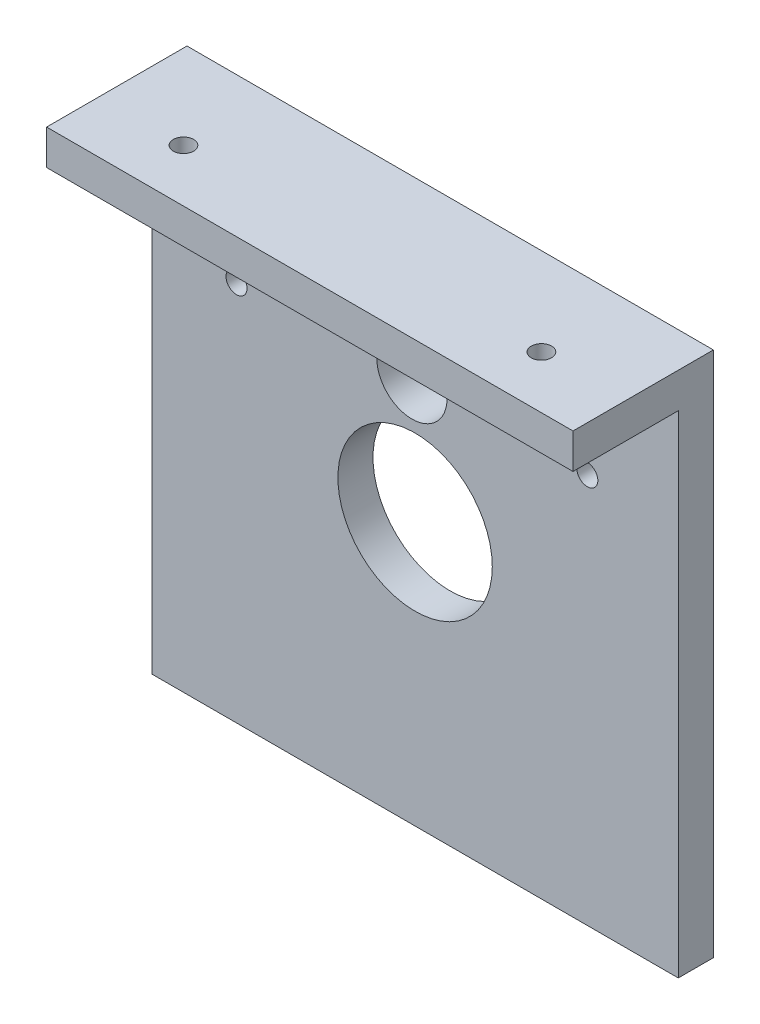
ISO-10303-21;
HEADER;
FILE_DESCRIPTION(('STEP AP214'),'2;1');
FILE_NAME('part.step','',(''),(''),'','','');
FILE_SCHEMA(('AUTOMOTIVE_DESIGN { 1 0 10303 214 1 1 1 1 }'));
ENDSEC;
DATA;
#1=APPLICATION_CONTEXT('core data for automotive mechanical design processes');
#2=APPLICATION_PROTOCOL_DEFINITION('international standard','automotive_design',2000,#1);
#3=PRODUCT_CONTEXT('',#1,'mechanical');
#4=PRODUCT('Part','Part','',(#3));
#5=PRODUCT_RELATED_PRODUCT_CATEGORY('part','',(#4));
#6=PRODUCT_DEFINITION_FORMATION('','',#4);
#7=PRODUCT_DEFINITION_CONTEXT('part definition',#1,'design');
#8=PRODUCT_DEFINITION('design','',#6,#7);
#9=PRODUCT_DEFINITION_SHAPE('','',#8);
#10=(LENGTH_UNIT() NAMED_UNIT(*) SI_UNIT(.MILLI.,.METRE.));
#11=(NAMED_UNIT(*) PLANE_ANGLE_UNIT() SI_UNIT($,.RADIAN.));
#12=(NAMED_UNIT(*) SI_UNIT($,.STERADIAN.) SOLID_ANGLE_UNIT());
#13=UNCERTAINTY_MEASURE_WITH_UNIT(LENGTH_MEASURE(1.E-05),#10,'distance_accuracy_value','');
#14=(GEOMETRIC_REPRESENTATION_CONTEXT(3) GLOBAL_UNCERTAINTY_ASSIGNED_CONTEXT((#13)) GLOBAL_UNIT_ASSIGNED_CONTEXT((#10,
#11,#12)) REPRESENTATION_CONTEXT('',''));
#15=CARTESIAN_POINT('',(0.,0.,0.));
#16=DIRECTION('',(0.,0.,1.));
#17=DIRECTION('',(1.,0.,0.));
#18=AXIS2_PLACEMENT_3D('',#15,#16,#17);
#19=CARTESIAN_POINT('',(0.,0.,5.));
#20=DIRECTION('',(0.,0.,1.));
#21=DIRECTION('',(1.,0.,0.));
#22=AXIS2_PLACEMENT_3D('',#19,#20,#21);
#23=PLANE('',#22);
#24=DIRECTION('',(1.,0.,0.));
#25=VECTOR('',#24,1.);
#26=CARTESIAN_POINT('',(-35.6377340404594,40.0070496723968,5.));
#27=LINE('',#26,#25);
#28=CARTESIAN_POINT('',(-35.6377340404594,40.0070496723968,5.));
#29=VERTEX_POINT('',#28);
#30=CARTESIAN_POINT('',(39.3622659595406,40.0070496723968,5.));
#31=VERTEX_POINT('',#30);
#32=EDGE_CURVE('E50',#29,#31,#27,.T.);
#33=ORIENTED_EDGE('',*,*,#32,.F.);
#34=DIRECTION('',(0.,-1.,0.));
#35=VECTOR('',#34,1.);
#36=CARTESIAN_POINT('',(-35.6377340404594,45.0070496723968,5.));
#37=LINE('',#36,#35);
#38=CARTESIAN_POINT('',(-35.6377340404594,-29.9929503276032,5.));
#39=VERTEX_POINT('',#38);
#40=EDGE_CURVE('E87',#29,#39,#37,.T.);
#41=ORIENTED_EDGE('',*,*,#40,.T.);
#42=DIRECTION('',(1.,0.,0.));
#43=VECTOR('',#42,1.);
#44=CARTESIAN_POINT('',(-35.6377340404594,-29.9929503276032,5.));
#45=LINE('',#44,#43);
#46=CARTESIAN_POINT('',(39.3622659595406,-29.9929503276032,5.));
#47=VERTEX_POINT('',#46);
#48=EDGE_CURVE('E56',#39,#47,#45,.T.);
#49=ORIENTED_EDGE('',*,*,#48,.T.);
#50=DIRECTION('',(0.,1.,0.));
#51=VECTOR('',#50,1.);
#52=CARTESIAN_POINT('',(39.3622659595406,45.0070496723968,5.));
#53=LINE('',#52,#51);
#54=EDGE_CURVE('E98',#47,#31,#53,.T.);
#55=ORIENTED_EDGE('',*,*,#54,.T.);
#56=EDGE_LOOP('',(#33,#41,#49,#55));
#57=FACE_BOUND('',#56,.T.);
#58=CARTESIAN_POINT('',(-23.5824724793545,24.353867941026,5.));
#59=DIRECTION('',(0.,0.,1.));
#60=DIRECTION('',(1.,0.,0.));
#61=AXIS2_PLACEMENT_3D('',#58,#59,#60);
#62=CIRCLE('',#61,1.5);
#63=CARTESIAN_POINT('',(-22.0824724793545,24.353867941026,5.));
#64=VERTEX_POINT('',#63);
#65=EDGE_CURVE('E157',#64,#64,#62,.T.);
#66=ORIENTED_EDGE('',*,*,#65,.F.);
#67=EDGE_LOOP('',(#66));
#68=FACE_BOUND('',#67,.T.);
#69=CARTESIAN_POINT('',(1.86226595954061,7.50704967239682,5.));
#70=DIRECTION('',(0.,0.,1.));
#71=DIRECTION('',(1.,0.,0.));
#72=AXIS2_PLACEMENT_3D('',#69,#70,#71);
#73=CIRCLE('',#72,11.);
#74=CARTESIAN_POINT('',(12.8622659595406,7.50704967239682,5.));
#75=VERTEX_POINT('',#74);
#76=EDGE_CURVE('E103',#75,#75,#73,.T.);
#77=ORIENTED_EDGE('',*,*,#76,.F.);
#78=EDGE_LOOP('',(#77));
#79=FACE_BOUND('',#78,.T.);
#80=CARTESIAN_POINT('',(1.40914579375659,25.0011824635746,5.));
#81=DIRECTION('',(0.,0.,1.));
#82=DIRECTION('',(1.,0.,0.));
#83=AXIS2_PLACEMENT_3D('',#80,#81,#82);
#84=CIRCLE('',#83,5.00000000000007);
#85=CARTESIAN_POINT('',(6.40914579375666,25.0011824635746,5.));
#86=VERTEX_POINT('',#85);
#87=EDGE_CURVE('E163',#86,#86,#84,.T.);
#88=ORIENTED_EDGE('',*,*,#87,.F.);
#89=EDGE_LOOP('',(#88));
#90=FACE_BOUND('',#89,.T.);
#91=CARTESIAN_POINT('',(26.4007640668676,25.648496986123,5.));
#92=DIRECTION('',(0.,0.,1.));
#93=DIRECTION('',(1.,0.,0.));
#94=AXIS2_PLACEMENT_3D('',#91,#92,#93);
#95=CIRCLE('',#94,1.5);
#96=CARTESIAN_POINT('',(27.9007640668676,25.648496986123,5.));
#97=VERTEX_POINT('',#96);
#98=EDGE_CURVE('E151',#97,#97,#95,.T.);
#99=ORIENTED_EDGE('',*,*,#98,.F.);
#100=EDGE_LOOP('',(#99));
#101=FACE_BOUND('',#100,.T.);
#102=ADVANCED_FACE('F33',(#57,#68,#79,#90,#101),#23,.T.);
#103=CARTESIAN_POINT('',(0.,0.,0.));
#104=DIRECTION('',(0.,0.,1.));
#105=DIRECTION('',(1.,0.,0.));
#106=AXIS2_PLACEMENT_3D('',#103,#104,#105);
#107=PLANE('',#106);
#108=CARTESIAN_POINT('',(-23.5824724793545,24.353867941026,0.));
#109=DIRECTION('',(0.,0.,1.));
#110=DIRECTION('',(1.,0.,0.));
#111=AXIS2_PLACEMENT_3D('',#108,#109,#110);
#112=CIRCLE('',#111,1.5);
#113=CARTESIAN_POINT('',(-22.0824724793545,24.353867941026,0.));
#114=VERTEX_POINT('',#113);
#115=EDGE_CURVE('E154',#114,#114,#112,.T.);
#116=ORIENTED_EDGE('',*,*,#115,.T.);
#117=EDGE_LOOP('',(#116));
#118=FACE_BOUND('',#117,.T.);
#119=CARTESIAN_POINT('',(1.86226595954061,7.50704967239682,0.));
#120=DIRECTION('',(0.,0.,1.));
#121=DIRECTION('',(1.,0.,0.));
#122=AXIS2_PLACEMENT_3D('',#119,#120,#121);
#123=CIRCLE('',#122,11.);
#124=CARTESIAN_POINT('',(12.8622659595406,7.50704967239682,0.));
#125=VERTEX_POINT('',#124);
#126=EDGE_CURVE('E107',#125,#125,#123,.T.);
#127=ORIENTED_EDGE('',*,*,#126,.T.);
#128=EDGE_LOOP('',(#127));
#129=FACE_BOUND('',#128,.T.);
#130=DIRECTION('',(0.,-1.,0.));
#131=VECTOR('',#130,1.);
#132=CARTESIAN_POINT('',(-35.6377340404594,45.0070496723968,0.));
#133=LINE('',#132,#131);
#134=CARTESIAN_POINT('',(-35.6377340404594,45.0070496723968,0.));
#135=VERTEX_POINT('',#134);
#136=CARTESIAN_POINT('',(-35.6377340404594,-29.9929503276032,0.));
#137=VERTEX_POINT('',#136);
#138=EDGE_CURVE('E94',#135,#137,#133,.T.);
#139=ORIENTED_EDGE('',*,*,#138,.F.);
#140=DIRECTION('',(-1.,0.,0.));
#141=VECTOR('',#140,1.);
#142=CARTESIAN_POINT('',(-35.6377340404594,45.0070496723968,0.));
#143=LINE('',#142,#141);
#144=CARTESIAN_POINT('',(39.3622659595406,45.0070496723968,0.));
#145=VERTEX_POINT('',#144);
#146=EDGE_CURVE('E76',#145,#135,#143,.T.);
#147=ORIENTED_EDGE('',*,*,#146,.F.);
#148=DIRECTION('',(0.,1.,0.));
#149=VECTOR('',#148,1.);
#150=CARTESIAN_POINT('',(39.3622659595406,45.0070496723968,0.));
#151=LINE('',#150,#149);
#152=CARTESIAN_POINT('',(39.3622659595406,-29.9929503276032,0.));
#153=VERTEX_POINT('',#152);
#154=EDGE_CURVE('E88',#153,#145,#151,.T.);
#155=ORIENTED_EDGE('',*,*,#154,.F.);
#156=DIRECTION('',(1.,0.,0.));
#157=VECTOR('',#156,1.);
#158=CARTESIAN_POINT('',(-35.6377340404594,-29.9929503276032,0.));
#159=LINE('',#158,#157);
#160=EDGE_CURVE('E102',#137,#153,#159,.T.);
#161=ORIENTED_EDGE('',*,*,#160,.F.);
#162=EDGE_LOOP('',(#139,#147,#155,#161));
#163=FACE_BOUND('',#162,.T.);
#164=CARTESIAN_POINT('',(1.40914579375659,25.0011824635746,0.));
#165=DIRECTION('',(0.,0.,1.));
#166=DIRECTION('',(1.,0.,0.));
#167=AXIS2_PLACEMENT_3D('',#164,#165,#166);
#168=CIRCLE('',#167,5.00000000000007);
#169=CARTESIAN_POINT('',(6.40914579375666,25.0011824635746,0.));
#170=VERTEX_POINT('',#169);
#171=EDGE_CURVE('E160',#170,#170,#168,.T.);
#172=ORIENTED_EDGE('',*,*,#171,.T.);
#173=EDGE_LOOP('',(#172));
#174=FACE_BOUND('',#173,.T.);
#175=CARTESIAN_POINT('',(26.4007640668676,25.648496986123,0.));
#176=DIRECTION('',(0.,0.,1.));
#177=DIRECTION('',(1.,0.,0.));
#178=AXIS2_PLACEMENT_3D('',#175,#176,#177);
#179=CIRCLE('',#178,1.5);
#180=CARTESIAN_POINT('',(27.9007640668676,25.648496986123,0.));
#181=VERTEX_POINT('',#180);
#182=EDGE_CURVE('E143',#181,#181,#179,.T.);
#183=ORIENTED_EDGE('',*,*,#182,.T.);
#184=EDGE_LOOP('',(#183));
#185=FACE_BOUND('',#184,.T.);
#186=ADVANCED_FACE('F100',(#118,#129,#163,#174,#185),#107,.F.);
#187=CARTESIAN_POINT('',(-35.6377340404594,45.0070496723968,5.));
#188=DIRECTION('',(1.,0.,0.));
#189=DIRECTION('',(0.,0.,-1.));
#190=AXIS2_PLACEMENT_3D('',#187,#188,#189);
#191=PLANE('',#190);
#192=ORIENTED_EDGE('',*,*,#138,.T.);
#193=DIRECTION('',(0.,0.,-1.));
#194=VECTOR('',#193,1.);
#195=CARTESIAN_POINT('',(-35.6377340404594,-29.9929503276032,5.));
#196=LINE('',#195,#194);
#197=EDGE_CURVE('E11',#39,#137,#196,.T.);
#198=ORIENTED_EDGE('',*,*,#197,.F.);
#199=ORIENTED_EDGE('',*,*,#40,.F.);
#200=DIRECTION('',(0.,0.,-1.));
#201=VECTOR('',#200,1.);
#202=CARTESIAN_POINT('',(-35.6377340404594,40.0070496723968,20.));
#203=LINE('',#202,#201);
#204=CARTESIAN_POINT('',(-35.6377340404594,40.0070496723968,20.));
#205=VERTEX_POINT('',#204);
#206=EDGE_CURVE('E136',#205,#29,#203,.T.);
#207=ORIENTED_EDGE('',*,*,#206,.F.);
#208=DIRECTION('',(0.,-1.,0.));
#209=VECTOR('',#208,1.);
#210=CARTESIAN_POINT('',(-35.6377340404594,45.0070496723968,20.));
#211=LINE('',#210,#209);
#212=CARTESIAN_POINT('',(-35.6377340404594,45.0070496723968,20.));
#213=VERTEX_POINT('',#212);
#214=EDGE_CURVE('E97',#213,#205,#211,.T.);
#215=ORIENTED_EDGE('',*,*,#214,.F.);
#216=DIRECTION('',(0.,0.,-1.));
#217=VECTOR('',#216,1.);
#218=CARTESIAN_POINT('',(-35.6377340404594,45.0070496723968,5.));
#219=LINE('',#218,#217);
#220=EDGE_CURVE('E80',#213,#135,#219,.T.);
#221=ORIENTED_EDGE('',*,*,#220,.T.);
#222=EDGE_LOOP('',(#192,#198,#199,#207,#215,#221));
#223=FACE_BOUND('',#222,.T.);
#224=ADVANCED_FACE('F35',(#223),#191,.F.);
#225=CARTESIAN_POINT('',(-35.6377340404594,-29.9929503276032,5.));
#226=DIRECTION('',(0.,1.,0.));
#227=DIRECTION('',(0.,0.,1.));
#228=AXIS2_PLACEMENT_3D('',#225,#226,#227);
#229=PLANE('',#228);
#230=ORIENTED_EDGE('',*,*,#160,.T.);
#231=DIRECTION('',(0.,0.,-1.));
#232=VECTOR('',#231,1.);
#233=CARTESIAN_POINT('',(39.3622659595406,-29.9929503276032,5.));
#234=LINE('',#233,#232);
#235=EDGE_CURVE('E42',#47,#153,#234,.T.);
#236=ORIENTED_EDGE('',*,*,#235,.F.);
#237=ORIENTED_EDGE('',*,*,#48,.F.);
#238=ORIENTED_EDGE('',*,*,#197,.T.);
#239=EDGE_LOOP('',(#230,#236,#237,#238));
#240=FACE_BOUND('',#239,.T.);
#241=ADVANCED_FACE('F197',(#240),#229,.F.);
#242=CARTESIAN_POINT('',(39.3622659595406,45.0070496723968,5.));
#243=DIRECTION('',(-1.,0.,0.));
#244=DIRECTION('',(0.,-1.,0.));
#245=AXIS2_PLACEMENT_3D('',#242,#243,#244);
#246=PLANE('',#245);
#247=ORIENTED_EDGE('',*,*,#154,.T.);
#248=DIRECTION('',(0.,0.,-1.));
#249=VECTOR('',#248,1.);
#250=CARTESIAN_POINT('',(39.3622659595406,45.0070496723968,5.));
#251=LINE('',#250,#249);
#252=CARTESIAN_POINT('',(39.3622659595406,45.0070496723968,20.));
#253=VERTEX_POINT('',#252);
#254=EDGE_CURVE('E83',#253,#145,#251,.T.);
#255=ORIENTED_EDGE('',*,*,#254,.F.);
#256=DIRECTION('',(0.,1.,0.));
#257=VECTOR('',#256,1.);
#258=CARTESIAN_POINT('',(39.3622659595406,45.0070496723968,20.));
#259=LINE('',#258,#257);
#260=CARTESIAN_POINT('',(39.3622659595406,40.0070496723968,20.));
#261=VERTEX_POINT('',#260);
#262=EDGE_CURVE('E140',#261,#253,#259,.T.);
#263=ORIENTED_EDGE('',*,*,#262,.F.);
#264=DIRECTION('',(0.,0.,-1.));
#265=VECTOR('',#264,1.);
#266=CARTESIAN_POINT('',(39.3622659595406,40.0070496723968,20.));
#267=LINE('',#266,#265);
#268=EDGE_CURVE('E134',#261,#31,#267,.T.);
#269=ORIENTED_EDGE('',*,*,#268,.T.);
#270=ORIENTED_EDGE('',*,*,#54,.F.);
#271=ORIENTED_EDGE('',*,*,#235,.T.);
#272=EDGE_LOOP('',(#247,#255,#263,#269,#270,#271));
#273=FACE_BOUND('',#272,.T.);
#274=ADVANCED_FACE('F138',(#273),#246,.F.);
#275=CARTESIAN_POINT('',(-35.6377340404594,45.0070496723968,5.));
#276=DIRECTION('',(0.,-1.,0.));
#277=DIRECTION('',(1.,0.,0.));
#278=AXIS2_PLACEMENT_3D('',#275,#276,#277);
#279=PLANE('',#278);
#280=CARTESIAN_POINT('',(27.3622659595406,45.0070496723968,12.5));
#281=DIRECTION('',(0.,-1.,0.));
#282=DIRECTION('',(0.,0.,-1.));
#283=AXIS2_PLACEMENT_3D('',#280,#281,#282);
#284=CIRCLE('',#283,1.44999999999999);
#285=CARTESIAN_POINT('',(27.3622659595406,45.0070496723968,11.05));
#286=VERTEX_POINT('',#285);
#287=EDGE_CURVE('E220',#286,#286,#284,.T.);
#288=ORIENTED_EDGE('',*,*,#287,.T.);
#289=EDGE_LOOP('',(#288));
#290=FACE_BOUND('',#289,.T.);
#291=CARTESIAN_POINT('',(-23.6377340404594,45.0070496723968,12.5));
#292=DIRECTION('',(0.,-1.,0.));
#293=DIRECTION('',(0.,0.,-1.));
#294=AXIS2_PLACEMENT_3D('',#291,#292,#293);
#295=CIRCLE('',#294,1.44999999999999);
#296=CARTESIAN_POINT('',(-23.6377340404594,45.0070496723968,11.05));
#297=VERTEX_POINT('',#296);
#298=EDGE_CURVE('E137',#297,#297,#295,.T.);
#299=ORIENTED_EDGE('',*,*,#298,.T.);
#300=EDGE_LOOP('',(#299));
#301=FACE_BOUND('',#300,.T.);
#302=ORIENTED_EDGE('',*,*,#146,.T.);
#303=ORIENTED_EDGE('',*,*,#220,.F.);
#304=DIRECTION('',(-1.,0.,0.));
#305=VECTOR('',#304,1.);
#306=CARTESIAN_POINT('',(-35.6377340404594,45.0070496723968,20.));
#307=LINE('',#306,#305);
#308=EDGE_CURVE('E141',#253,#213,#307,.T.);
#309=ORIENTED_EDGE('',*,*,#308,.F.);
#310=ORIENTED_EDGE('',*,*,#254,.T.);
#311=EDGE_LOOP('',(#302,#303,#309,#310));
#312=FACE_BOUND('',#311,.T.);
#313=ADVANCED_FACE('F78',(#290,#301,#312),#279,.F.);
#314=CARTESIAN_POINT('',(1.86226595954061,7.50704967239682,5.));
#315=DIRECTION('',(0.,0.,-1.));
#316=DIRECTION('',(-1.,0.,0.));
#317=AXIS2_PLACEMENT_3D('',#314,#315,#316);
#318=CYLINDRICAL_SURFACE('',#317,11.);
#319=ORIENTED_EDGE('',*,*,#76,.T.);
#320=EDGE_LOOP('',(#319));
#321=FACE_BOUND('',#320,.T.);
#322=ORIENTED_EDGE('',*,*,#126,.F.);
#323=EDGE_LOOP('',(#322));
#324=FACE_BOUND('',#323,.T.);
#325=ADVANCED_FACE('F173',(#321,#324),#318,.F.);
#326=CARTESIAN_POINT('',(1.40914579375659,25.0011824635746,5.));
#327=DIRECTION('',(0.,0.,-1.));
#328=DIRECTION('',(-1.,0.,0.));
#329=AXIS2_PLACEMENT_3D('',#326,#327,#328);
#330=CYLINDRICAL_SURFACE('',#329,5.00000000000007);
#331=ORIENTED_EDGE('',*,*,#87,.T.);
#332=EDGE_LOOP('',(#331));
#333=FACE_BOUND('',#332,.T.);
#334=ORIENTED_EDGE('',*,*,#171,.F.);
#335=EDGE_LOOP('',(#334));
#336=FACE_BOUND('',#335,.T.);
#337=ADVANCED_FACE('F170',(#333,#336),#330,.F.);
#338=CARTESIAN_POINT('',(-23.5824724793545,24.353867941026,5.));
#339=DIRECTION('',(0.,0.,-1.));
#340=DIRECTION('',(-1.,0.,0.));
#341=AXIS2_PLACEMENT_3D('',#338,#339,#340);
#342=CYLINDRICAL_SURFACE('',#341,1.5);
#343=ORIENTED_EDGE('',*,*,#65,.T.);
#344=EDGE_LOOP('',(#343));
#345=FACE_BOUND('',#344,.T.);
#346=ORIENTED_EDGE('',*,*,#115,.F.);
#347=EDGE_LOOP('',(#346));
#348=FACE_BOUND('',#347,.T.);
#349=ADVANCED_FACE('F172',(#345,#348),#342,.F.);
#350=CARTESIAN_POINT('',(26.4007640668676,25.648496986123,5.));
#351=DIRECTION('',(0.,0.,-1.));
#352=DIRECTION('',(-1.,0.,0.));
#353=AXIS2_PLACEMENT_3D('',#350,#351,#352);
#354=CYLINDRICAL_SURFACE('',#353,1.5);
#355=ORIENTED_EDGE('',*,*,#98,.T.);
#356=EDGE_LOOP('',(#355));
#357=FACE_BOUND('',#356,.T.);
#358=ORIENTED_EDGE('',*,*,#182,.F.);
#359=EDGE_LOOP('',(#358));
#360=FACE_BOUND('',#359,.T.);
#361=ADVANCED_FACE('F180',(#357,#360),#354,.F.);
#362=CARTESIAN_POINT('',(-35.6377340404594,40.0070496723968,20.));
#363=DIRECTION('',(0.,1.,0.));
#364=DIRECTION('',(0.,0.,1.));
#365=AXIS2_PLACEMENT_3D('',#362,#363,#364);
#366=PLANE('',#365);
#367=CARTESIAN_POINT('',(27.3622659595406,40.0070496723968,12.5));
#368=DIRECTION('',(0.,-1.,0.));
#369=DIRECTION('',(0.,0.,-1.));
#370=AXIS2_PLACEMENT_3D('',#367,#368,#369);
#371=CIRCLE('',#370,2.75);
#372=CARTESIAN_POINT('',(27.3622659595406,40.0070496723968,9.75));
#373=VERTEX_POINT('',#372);
#374=EDGE_CURVE('E226',#373,#373,#371,.T.);
#375=ORIENTED_EDGE('',*,*,#374,.F.);
#376=EDGE_LOOP('',(#375));
#377=FACE_BOUND('',#376,.T.);
#378=CARTESIAN_POINT('',(-23.6377340404594,40.0070496723968,12.5));
#379=DIRECTION('',(0.,-1.,0.));
#380=DIRECTION('',(0.,0.,-1.));
#381=AXIS2_PLACEMENT_3D('',#378,#379,#380);
#382=CIRCLE('',#381,2.75);
#383=CARTESIAN_POINT('',(-23.6377340404594,40.0070496723968,9.75));
#384=VERTEX_POINT('',#383);
#385=EDGE_CURVE('E217',#384,#384,#382,.T.);
#386=ORIENTED_EDGE('',*,*,#385,.F.);
#387=EDGE_LOOP('',(#386));
#388=FACE_BOUND('',#387,.T.);
#389=ORIENTED_EDGE('',*,*,#32,.T.);
#390=ORIENTED_EDGE('',*,*,#268,.F.);
#391=DIRECTION('',(1.,0.,0.));
#392=VECTOR('',#391,1.);
#393=CARTESIAN_POINT('',(-35.6377340404594,40.0070496723968,20.));
#394=LINE('',#393,#392);
#395=EDGE_CURVE('E208',#205,#261,#394,.T.);
#396=ORIENTED_EDGE('',*,*,#395,.F.);
#397=ORIENTED_EDGE('',*,*,#206,.T.);
#398=EDGE_LOOP('',(#389,#390,#396,#397));
#399=FACE_BOUND('',#398,.T.);
#400=ADVANCED_FACE('F131',(#377,#388,#399),#366,.F.);
#401=CARTESIAN_POINT('',(0.,0.,20.));
#402=DIRECTION('',(0.,0.,1.));
#403=DIRECTION('',(1.,0.,0.));
#404=AXIS2_PLACEMENT_3D('',#401,#402,#403);
#405=PLANE('',#404);
#406=ORIENTED_EDGE('',*,*,#214,.T.);
#407=ORIENTED_EDGE('',*,*,#395,.T.);
#408=ORIENTED_EDGE('',*,*,#262,.T.);
#409=ORIENTED_EDGE('',*,*,#308,.T.);
#410=EDGE_LOOP('',(#406,#407,#408,#409));
#411=FACE_BOUND('',#410,.T.);
#412=ADVANCED_FACE('F207',(#411),#405,.T.);
#413=CARTESIAN_POINT('',(-23.6377340404594,40.0070496723968,12.5));
#414=DIRECTION('',(0.,-1.,0.));
#415=DIRECTION('',(0.,0.,-1.));
#416=AXIS2_PLACEMENT_3D('',#413,#414,#415);
#417=CYLINDRICAL_SURFACE('',#416,1.44999999999999);
#418=ORIENTED_EDGE('',*,*,#298,.F.);
#419=EDGE_LOOP('',(#418));
#420=FACE_BOUND('',#419,.T.);
#421=CARTESIAN_POINT('',(-23.6377340404594,41.3070496723968,12.5));
#422=DIRECTION('',(0.,-1.,0.));
#423=DIRECTION('',(0.,0.,-1.));
#424=AXIS2_PLACEMENT_3D('',#421,#422,#423);
#425=CIRCLE('',#424,1.44999999999999);
#426=CARTESIAN_POINT('',(-23.6377340404594,41.3070496723968,11.05));
#427=VERTEX_POINT('',#426);
#428=EDGE_CURVE('E214',#427,#427,#425,.T.);
#429=ORIENTED_EDGE('',*,*,#428,.T.);
#430=EDGE_LOOP('',(#429));
#431=FACE_BOUND('',#430,.T.);
#432=ADVANCED_FACE('F240',(#420,#431),#417,.F.);
#433=CARTESIAN_POINT('',(-23.6377340404594,40.0070496723968,12.5));
#434=DIRECTION('',(0.,-1.,0.));
#435=DIRECTION('',(0.,0.,-1.));
#436=AXIS2_PLACEMENT_3D('',#433,#434,#435);
#437=CONICAL_SURFACE('',#436,2.75,0.785398163397448);
#438=ORIENTED_EDGE('',*,*,#428,.F.);
#439=EDGE_LOOP('',(#438));
#440=FACE_BOUND('',#439,.T.);
#441=ORIENTED_EDGE('',*,*,#385,.T.);
#442=EDGE_LOOP('',(#441));
#443=FACE_BOUND('',#442,.T.);
#444=ADVANCED_FACE('F237',(#440,#443),#437,.F.);
#445=CARTESIAN_POINT('',(27.3622659595406,40.0070496723968,12.5));
#446=DIRECTION('',(0.,-1.,0.));
#447=DIRECTION('',(0.,0.,-1.));
#448=AXIS2_PLACEMENT_3D('',#445,#446,#447);
#449=CYLINDRICAL_SURFACE('',#448,1.44999999999999);
#450=ORIENTED_EDGE('',*,*,#287,.F.);
#451=EDGE_LOOP('',(#450));
#452=FACE_BOUND('',#451,.T.);
#453=CARTESIAN_POINT('',(27.3622659595406,41.3070496723968,12.5));
#454=DIRECTION('',(0.,-1.,0.));
#455=DIRECTION('',(0.,0.,-1.));
#456=AXIS2_PLACEMENT_3D('',#453,#454,#455);
#457=CIRCLE('',#456,1.44999999999999);
#458=CARTESIAN_POINT('',(27.3622659595406,41.3070496723968,11.05));
#459=VERTEX_POINT('',#458);
#460=EDGE_CURVE('E223',#459,#459,#457,.T.);
#461=ORIENTED_EDGE('',*,*,#460,.T.);
#462=EDGE_LOOP('',(#461));
#463=FACE_BOUND('',#462,.T.);
#464=ADVANCED_FACE('F239',(#452,#463),#449,.F.);
#465=CARTESIAN_POINT('',(27.3622659595406,40.0070496723968,12.5));
#466=DIRECTION('',(0.,-1.,0.));
#467=DIRECTION('',(0.,0.,-1.));
#468=AXIS2_PLACEMENT_3D('',#465,#466,#467);
#469=CONICAL_SURFACE('',#468,2.75,0.78539816339745);
#470=ORIENTED_EDGE('',*,*,#460,.F.);
#471=EDGE_LOOP('',(#470));
#472=FACE_BOUND('',#471,.T.);
#473=ORIENTED_EDGE('',*,*,#374,.T.);
#474=EDGE_LOOP('',(#473));
#475=FACE_BOUND('',#474,.T.);
#476=ADVANCED_FACE('F230',(#472,#475),#469,.F.);
#477=CLOSED_SHELL('',(#102,#186,#224,#241,#274,#313,#325,#337,#349,#361,#400,#412,#432,#444,
#464,#476));
#478=MANIFOLD_SOLID_BREP('B2',#477);
#479=ADVANCED_BREP_SHAPE_REPRESENTATION('',(#18,#478),#14);
#480=SHAPE_DEFINITION_REPRESENTATION(#9,#479);
ENDSEC;
END-ISO-10303-21;
